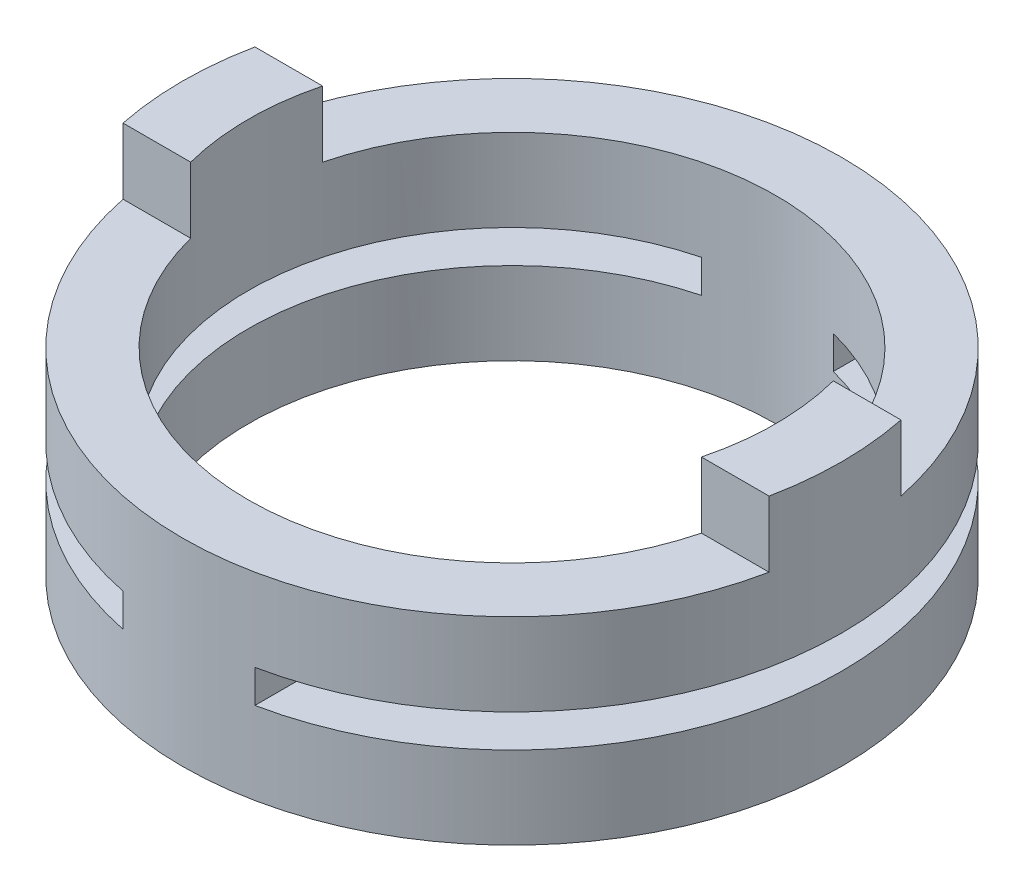
ISO-10303-21;
HEADER;
FILE_DESCRIPTION(('STEP AP214'),'2;1');
FILE_NAME('part.step','',(''),(''),'','','');
FILE_SCHEMA(('AUTOMOTIVE_DESIGN { 1 0 10303 214 1 1 1 1 }'));
ENDSEC;
DATA;
#1=APPLICATION_CONTEXT('core data for automotive mechanical design processes');
#2=APPLICATION_PROTOCOL_DEFINITION('international standard','automotive_design',2000,#1);
#3=PRODUCT_CONTEXT('',#1,'mechanical');
#4=PRODUCT('Part','Part','',(#3));
#5=PRODUCT_RELATED_PRODUCT_CATEGORY('part','',(#4));
#6=PRODUCT_DEFINITION_FORMATION('','',#4);
#7=PRODUCT_DEFINITION_CONTEXT('part definition',#1,'design');
#8=PRODUCT_DEFINITION('design','',#6,#7);
#9=PRODUCT_DEFINITION_SHAPE('','',#8);
#10=(LENGTH_UNIT() NAMED_UNIT(*) SI_UNIT(.MILLI.,.METRE.));
#11=(NAMED_UNIT(*) PLANE_ANGLE_UNIT() SI_UNIT($,.RADIAN.));
#12=(NAMED_UNIT(*) SI_UNIT($,.STERADIAN.) SOLID_ANGLE_UNIT());
#13=UNCERTAINTY_MEASURE_WITH_UNIT(LENGTH_MEASURE(1.E-05),#10,'distance_accuracy_value','');
#14=(GEOMETRIC_REPRESENTATION_CONTEXT(3) GLOBAL_UNCERTAINTY_ASSIGNED_CONTEXT((#13)) GLOBAL_UNIT_ASSIGNED_CONTEXT((#10,
#11,#12)) REPRESENTATION_CONTEXT('',''));
#15=CARTESIAN_POINT('',(0.,0.,0.));
#16=DIRECTION('',(0.,0.,1.));
#17=DIRECTION('',(1.,0.,0.));
#18=AXIS2_PLACEMENT_3D('',#15,#16,#17);
#19=CARTESIAN_POINT('',(0.,3.,0.));
#20=DIRECTION('',(0.,1.,0.));
#21=DIRECTION('',(0.,0.,1.));
#22=AXIS2_PLACEMENT_3D('',#19,#20,#21);
#23=PLANE('',#22);
#24=CARTESIAN_POINT('',(0.,3.,0.));
#25=DIRECTION('',(0.,1.,0.));
#26=DIRECTION('',(0.,0.,1.));
#27=AXIS2_PLACEMENT_3D('',#24,#25,#26);
#28=CIRCLE('',#27,4.);
#29=CARTESIAN_POINT('',(3.87298334620721,3.,1.));
#30=VERTEX_POINT('',#29);
#31=CARTESIAN_POINT('',(-3.87298334620721,3.,1.));
#32=VERTEX_POINT('',#31);
#33=EDGE_CURVE('E136',#30,#32,#28,.F.);
#34=ORIENTED_EDGE('',*,*,#33,.T.);
#35=DIRECTION('',(1.,0.,0.));
#36=VECTOR('',#35,1.);
#37=CARTESIAN_POINT('',(0.,3.,1.));
#38=LINE('',#37,#36);
#39=CARTESIAN_POINT('',(-4.89897948556635,3.,1.00000000000004));
#40=VERTEX_POINT('',#39);
#41=EDGE_CURVE('E132',#32,#40,#38,.F.);
#42=ORIENTED_EDGE('',*,*,#41,.T.);
#43=CARTESIAN_POINT('',(0.,3.,0.));
#44=DIRECTION('',(0.,1.,0.));
#45=DIRECTION('',(0.,0.,1.));
#46=AXIS2_PLACEMENT_3D('',#43,#44,#45);
#47=CIRCLE('',#46,5.);
#48=CARTESIAN_POINT('',(4.89897948556635,3.,1.00000000000004));
#49=VERTEX_POINT('',#48);
#50=EDGE_CURVE('E19',#49,#40,#47,.F.);
#51=ORIENTED_EDGE('',*,*,#50,.F.);
#52=DIRECTION('',(1.,0.,0.));
#53=VECTOR('',#52,1.);
#54=CARTESIAN_POINT('',(0.,3.,1.));
#55=LINE('',#54,#53);
#56=EDGE_CURVE('E126',#49,#30,#55,.F.);
#57=ORIENTED_EDGE('',*,*,#56,.T.);
#58=EDGE_LOOP('',(#34,#42,#51,#57));
#59=FACE_BOUND('',#58,.T.);
#60=ADVANCED_FACE('F16',(#59),#23,.T.);
#61=CARTESIAN_POINT('',(1.,1.75,-8.5));
#62=DIRECTION('',(-1.,0.,0.));
#63=DIRECTION('',(0.,0.,1.));
#64=AXIS2_PLACEMENT_3D('',#61,#62,#63);
#65=PLANE('',#64);
#66=DIRECTION('',(0.,1.,0.));
#67=VECTOR('',#66,1.);
#68=CARTESIAN_POINT('',(1.0000000000001,0.,3.87298334620739));
#69=LINE('',#68,#67);
#70=CARTESIAN_POINT('',(1.00000000000005,1.25,3.8729833462074));
#71=VERTEX_POINT('',#70);
#72=CARTESIAN_POINT('',(1.00000000000005,1.75,3.8729833462074));
#73=VERTEX_POINT('',#72);
#74=EDGE_CURVE('E166',#71,#73,#69,.T.);
#75=ORIENTED_EDGE('',*,*,#74,.T.);
#76=DIRECTION('',(0.,0.,1.));
#77=VECTOR('',#76,1.);
#78=CARTESIAN_POINT('',(1.,1.75,-8.5));
#79=LINE('',#78,#77);
#80=CARTESIAN_POINT('',(1.00000000000003,1.75,4.89897948556635));
#81=VERTEX_POINT('',#80);
#82=EDGE_CURVE('E215',#73,#81,#79,.T.);
#83=ORIENTED_EDGE('',*,*,#82,.T.);
#84=DIRECTION('',(0.,1.,0.));
#85=VECTOR('',#84,1.);
#86=CARTESIAN_POINT('',(1.00000000000007,0.,4.89897948556634));
#87=LINE('',#86,#85);
#88=CARTESIAN_POINT('',(1.00000000000003,1.25,4.89897948556635));
#89=VERTEX_POINT('',#88);
#90=EDGE_CURVE('E139',#89,#81,#87,.T.);
#91=ORIENTED_EDGE('',*,*,#90,.F.);
#92=DIRECTION('',(0.,0.,-1.));
#93=VECTOR('',#92,1.);
#94=CARTESIAN_POINT('',(1.,1.25,-8.5));
#95=LINE('',#94,#93);
#96=EDGE_CURVE('E212',#89,#71,#95,.T.);
#97=ORIENTED_EDGE('',*,*,#96,.T.);
#98=EDGE_LOOP('',(#75,#83,#91,#97));
#99=FACE_BOUND('',#98,.T.);
#100=ADVANCED_FACE('F275',(#99),#65,.F.);
#101=CARTESIAN_POINT('',(-1.,1.25,-8.5));
#102=DIRECTION('',(1.,0.,0.));
#103=DIRECTION('',(0.,0.,-1.));
#104=AXIS2_PLACEMENT_3D('',#101,#102,#103);
#105=PLANE('',#104);
#106=DIRECTION('',(0.,1.,0.));
#107=VECTOR('',#106,1.);
#108=CARTESIAN_POINT('',(-1.0000000000001,0.,3.87298334620739));
#109=LINE('',#108,#107);
#110=CARTESIAN_POINT('',(-1.00000000000005,1.75,3.8729833462074));
#111=VERTEX_POINT('',#110);
#112=CARTESIAN_POINT('',(-1.00000000000005,1.25,3.8729833462074));
#113=VERTEX_POINT('',#112);
#114=EDGE_CURVE('E220',#111,#113,#109,.F.);
#115=ORIENTED_EDGE('',*,*,#114,.T.);
#116=DIRECTION('',(0.,0.,-1.));
#117=VECTOR('',#116,1.);
#118=CARTESIAN_POINT('',(-1.,1.25,-8.5));
#119=LINE('',#118,#117);
#120=CARTESIAN_POINT('',(-1.,1.25,4.89897948556618));
#121=VERTEX_POINT('',#120);
#122=EDGE_CURVE('E205',#113,#121,#119,.F.);
#123=ORIENTED_EDGE('',*,*,#122,.T.);
#124=DIRECTION('',(0.,1.,0.));
#125=VECTOR('',#124,1.);
#126=CARTESIAN_POINT('',(-1.,1.25,4.898979485566));
#127=LINE('',#126,#125);
#128=CARTESIAN_POINT('',(-1.,1.75,4.89897948556618));
#129=VERTEX_POINT('',#128);
#130=EDGE_CURVE('E155',#129,#121,#127,.F.);
#131=ORIENTED_EDGE('',*,*,#130,.F.);
#132=DIRECTION('',(0.,0.,1.));
#133=VECTOR('',#132,1.);
#134=CARTESIAN_POINT('',(-1.,1.75,-8.5));
#135=LINE('',#134,#133);
#136=EDGE_CURVE('E201',#129,#111,#135,.F.);
#137=ORIENTED_EDGE('',*,*,#136,.T.);
#138=EDGE_LOOP('',(#115,#123,#131,#137));
#139=FACE_BOUND('',#138,.T.);
#140=ADVANCED_FACE('F430',(#139),#105,.F.);
#141=CARTESIAN_POINT('',(0.,0.,0.));
#142=DIRECTION('',(0.,1.,0.));
#143=DIRECTION('',(0.,0.,1.));
#144=AXIS2_PLACEMENT_3D('',#141,#142,#143);
#145=CYLINDRICAL_SURFACE('',#144,4.);
#146=CARTESIAN_POINT('',(0.,3.,0.));
#147=DIRECTION('',(0.,1.,0.));
#148=DIRECTION('',(0.,0.,1.));
#149=AXIS2_PLACEMENT_3D('',#146,#147,#148);
#150=CIRCLE('',#149,4.);
#151=CARTESIAN_POINT('',(-3.8729833462074,3.,-1.00000000000005));
#152=VERTEX_POINT('',#151);
#153=CARTESIAN_POINT('',(3.87298334620721,3.,-1.));
#154=VERTEX_POINT('',#153);
#155=EDGE_CURVE('E190',#152,#154,#150,.F.);
#156=ORIENTED_EDGE('',*,*,#155,.F.);
#157=DIRECTION('',(0.,1.,0.));
#158=VECTOR('',#157,1.);
#159=CARTESIAN_POINT('',(-3.87298334620739,0.,-1.0000000000001));
#160=LINE('',#159,#158);
#161=CARTESIAN_POINT('',(-3.8729833462074,4.,-1.00000000000005));
#162=VERTEX_POINT('',#161);
#163=EDGE_CURVE('E157',#162,#152,#160,.F.);
#164=ORIENTED_EDGE('',*,*,#163,.F.);
#165=CARTESIAN_POINT('',(0.,4.,0.));
#166=DIRECTION('',(0.,1.,0.));
#167=DIRECTION('',(0.,0.,1.));
#168=AXIS2_PLACEMENT_3D('',#165,#166,#167);
#169=CIRCLE('',#168,4.);
#170=CARTESIAN_POINT('',(-3.87298334620721,4.,1.));
#171=VERTEX_POINT('',#170);
#172=EDGE_CURVE('E195',#171,#162,#169,.F.);
#173=ORIENTED_EDGE('',*,*,#172,.F.);
#174=DIRECTION('',(0.,1.,0.));
#175=VECTOR('',#174,1.);
#176=CARTESIAN_POINT('',(-3.872983346207,3.,1.));
#177=LINE('',#176,#175);
#178=EDGE_CURVE('E249',#32,#171,#177,.T.);
#179=ORIENTED_EDGE('',*,*,#178,.F.);
#180=ORIENTED_EDGE('',*,*,#33,.F.);
#181=DIRECTION('',(0.,1.,0.));
#182=VECTOR('',#181,1.);
#183=CARTESIAN_POINT('',(3.872983346207,3.,1.));
#184=LINE('',#183,#182);
#185=CARTESIAN_POINT('',(3.87298334620721,4.,1.));
#186=VERTEX_POINT('',#185);
#187=EDGE_CURVE('E168',#186,#30,#184,.F.);
#188=ORIENTED_EDGE('',*,*,#187,.F.);
#189=CARTESIAN_POINT('',(0.,4.,0.));
#190=DIRECTION('',(0.,1.,0.));
#191=DIRECTION('',(0.,0.,1.));
#192=AXIS2_PLACEMENT_3D('',#189,#190,#191);
#193=CIRCLE('',#192,4.);
#194=CARTESIAN_POINT('',(3.87298334620721,4.,-1.));
#195=VERTEX_POINT('',#194);
#196=EDGE_CURVE('E216',#195,#186,#193,.F.);
#197=ORIENTED_EDGE('',*,*,#196,.F.);
#198=DIRECTION('',(0.,1.,0.));
#199=VECTOR('',#198,1.);
#200=CARTESIAN_POINT('',(3.872983346207,3.,-1.));
#201=LINE('',#200,#199);
#202=EDGE_CURVE('E218',#154,#195,#201,.T.);
#203=ORIENTED_EDGE('',*,*,#202,.F.);
#204=EDGE_LOOP('',(#156,#164,#173,#179,#180,#188,#197,#203));
#205=FACE_BOUND('',#204,.T.);
#206=DIRECTION('',(0.,1.,0.));
#207=VECTOR('',#206,1.);
#208=CARTESIAN_POINT('',(1.,1.75,-3.872983346207));
#209=LINE('',#208,#207);
#210=CARTESIAN_POINT('',(1.,1.25,-3.87298334620721));
#211=VERTEX_POINT('',#210);
#212=CARTESIAN_POINT('',(1.,1.75,-3.87298334620721));
#213=VERTEX_POINT('',#212);
#214=EDGE_CURVE('E234',#211,#213,#209,.T.);
#215=ORIENTED_EDGE('',*,*,#214,.T.);
#216=CARTESIAN_POINT('',(0.,1.75,0.));
#217=DIRECTION('',(0.,1.,0.));
#218=DIRECTION('',(0.,0.,1.));
#219=AXIS2_PLACEMENT_3D('',#216,#217,#218);
#220=CIRCLE('',#219,4.);
#221=EDGE_CURVE('E169',#213,#73,#220,.F.);
#222=ORIENTED_EDGE('',*,*,#221,.T.);
#223=ORIENTED_EDGE('',*,*,#74,.F.);
#224=CARTESIAN_POINT('',(0.,1.25,0.));
#225=DIRECTION('',(0.,1.,0.));
#226=DIRECTION('',(0.,0.,1.));
#227=AXIS2_PLACEMENT_3D('',#224,#225,#226);
#228=CIRCLE('',#227,4.);
#229=EDGE_CURVE('E210',#71,#211,#228,.T.);
#230=ORIENTED_EDGE('',*,*,#229,.T.);
#231=EDGE_LOOP('',(#215,#222,#223,#230));
#232=FACE_BOUND('',#231,.T.);
#233=CARTESIAN_POINT('',(0.,0.,0.));
#234=DIRECTION('',(0.,1.,0.));
#235=DIRECTION('',(0.,0.,1.));
#236=AXIS2_PLACEMENT_3D('',#233,#234,#235);
#237=CIRCLE('',#236,4.);
#238=CARTESIAN_POINT('',(0.,0.,4.));
#239=VERTEX_POINT('',#238);
#240=EDGE_CURVE('E206',#239,#239,#237,.F.);
#241=ORIENTED_EDGE('',*,*,#240,.T.);
#242=EDGE_LOOP('',(#241));
#243=FACE_BOUND('',#242,.T.);
#244=DIRECTION('',(0.,1.,0.));
#245=VECTOR('',#244,1.);
#246=CARTESIAN_POINT('',(-1.,1.25,-3.872983346207));
#247=LINE('',#246,#245);
#248=CARTESIAN_POINT('',(-1.,1.75,-3.87298334620721));
#249=VERTEX_POINT('',#248);
#250=CARTESIAN_POINT('',(-1.,1.25,-3.87298334620721));
#251=VERTEX_POINT('',#250);
#252=EDGE_CURVE('E232',#249,#251,#247,.F.);
#253=ORIENTED_EDGE('',*,*,#252,.T.);
#254=CARTESIAN_POINT('',(0.,1.25,0.));
#255=DIRECTION('',(0.,1.,0.));
#256=DIRECTION('',(0.,0.,1.));
#257=AXIS2_PLACEMENT_3D('',#254,#255,#256);
#258=CIRCLE('',#257,4.);
#259=EDGE_CURVE('E202',#251,#113,#258,.T.);
#260=ORIENTED_EDGE('',*,*,#259,.T.);
#261=ORIENTED_EDGE('',*,*,#114,.F.);
#262=CARTESIAN_POINT('',(0.,1.75,0.));
#263=DIRECTION('',(0.,1.,0.));
#264=DIRECTION('',(0.,0.,1.));
#265=AXIS2_PLACEMENT_3D('',#262,#263,#264);
#266=CIRCLE('',#265,4.);
#267=EDGE_CURVE('E198',#111,#249,#266,.F.);
#268=ORIENTED_EDGE('',*,*,#267,.T.);
#269=EDGE_LOOP('',(#253,#260,#261,#268));
#270=FACE_BOUND('',#269,.T.);
#271=ADVANCED_FACE('F276',(#205,#232,#243,#270),#145,.F.);
#272=CARTESIAN_POINT('',(4.898979485566,3.,-1.));
#273=DIRECTION('',(0.,0.,-1.));
#274=DIRECTION('',(-1.,0.,0.));
#275=AXIS2_PLACEMENT_3D('',#272,#273,#274);
#276=PLANE('',#275);
#277=DIRECTION('',(0.,1.,0.));
#278=VECTOR('',#277,1.);
#279=CARTESIAN_POINT('',(4.89897948556634,0.,-1.00000000000007));
#280=LINE('',#279,#278);
#281=CARTESIAN_POINT('',(4.89897948556635,3.,-1.00000000000003));
#282=VERTEX_POINT('',#281);
#283=CARTESIAN_POINT('',(4.89897948556635,4.,-1.00000000000003));
#284=VERTEX_POINT('',#283);
#285=EDGE_CURVE('E189',#282,#284,#280,.T.);
#286=ORIENTED_EDGE('',*,*,#285,.F.);
#287=DIRECTION('',(1.,0.,0.));
#288=VECTOR('',#287,1.);
#289=CARTESIAN_POINT('',(0.,3.,-1.));
#290=LINE('',#289,#288);
#291=EDGE_CURVE('E193',#154,#282,#290,.T.);
#292=ORIENTED_EDGE('',*,*,#291,.F.);
#293=ORIENTED_EDGE('',*,*,#202,.T.);
#294=DIRECTION('',(1.,0.,0.));
#295=VECTOR('',#294,1.);
#296=CARTESIAN_POINT('',(0.,4.,-1.));
#297=LINE('',#296,#295);
#298=EDGE_CURVE('E217',#284,#195,#297,.F.);
#299=ORIENTED_EDGE('',*,*,#298,.F.);
#300=EDGE_LOOP('',(#286,#292,#293,#299));
#301=FACE_BOUND('',#300,.T.);
#302=ADVANCED_FACE('F413',(#301),#276,.T.);
#303=CARTESIAN_POINT('',(0.,4.,0.));
#304=DIRECTION('',(0.,1.,0.));
#305=DIRECTION('',(0.,0.,1.));
#306=AXIS2_PLACEMENT_3D('',#303,#304,#305);
#307=PLANE('',#306);
#308=DIRECTION('',(1.,0.,0.));
#309=VECTOR('',#308,1.);
#310=CARTESIAN_POINT('',(3.872983346207,4.,1.));
#311=LINE('',#310,#309);
#312=CARTESIAN_POINT('',(4.89897948556635,4.,1.00000000000004));
#313=VERTEX_POINT('',#312);
#314=EDGE_CURVE('E170',#313,#186,#311,.F.);
#315=ORIENTED_EDGE('',*,*,#314,.F.);
#316=CARTESIAN_POINT('',(0.,4.,0.));
#317=DIRECTION('',(0.,1.,0.));
#318=DIRECTION('',(0.,0.,1.));
#319=AXIS2_PLACEMENT_3D('',#316,#317,#318);
#320=CIRCLE('',#319,5.);
#321=EDGE_CURVE('E187',#284,#313,#320,.F.);
#322=ORIENTED_EDGE('',*,*,#321,.F.);
#323=ORIENTED_EDGE('',*,*,#298,.T.);
#324=ORIENTED_EDGE('',*,*,#196,.T.);
#325=EDGE_LOOP('',(#315,#322,#323,#324));
#326=FACE_BOUND('',#325,.T.);
#327=ADVANCED_FACE('F289',(#326),#307,.T.);
#328=CARTESIAN_POINT('',(3.872983346207,3.,1.));
#329=DIRECTION('',(0.,0.,1.));
#330=DIRECTION('',(1.,0.,0.));
#331=AXIS2_PLACEMENT_3D('',#328,#329,#330);
#332=PLANE('',#331);
#333=ORIENTED_EDGE('',*,*,#187,.T.);
#334=ORIENTED_EDGE('',*,*,#56,.F.);
#335=DIRECTION('',(0.,1.,0.));
#336=VECTOR('',#335,1.);
#337=CARTESIAN_POINT('',(4.89897948556634,0.,1.00000000000007));
#338=LINE('',#337,#336);
#339=EDGE_CURVE('E154',#313,#49,#338,.F.);
#340=ORIENTED_EDGE('',*,*,#339,.F.);
#341=ORIENTED_EDGE('',*,*,#314,.T.);
#342=EDGE_LOOP('',(#333,#334,#340,#341));
#343=FACE_BOUND('',#342,.T.);
#344=ADVANCED_FACE('F281',(#343),#332,.T.);
#345=CARTESIAN_POINT('',(5.769806222619,1.75,-8.5));
#346=DIRECTION('',(0.,1.,0.));
#347=DIRECTION('',(0.,0.,1.));
#348=AXIS2_PLACEMENT_3D('',#345,#346,#347);
#349=PLANE('',#348);
#350=ORIENTED_EDGE('',*,*,#82,.F.);
#351=ORIENTED_EDGE('',*,*,#221,.F.);
#352=DIRECTION('',(0.,0.,1.));
#353=VECTOR('',#352,1.);
#354=CARTESIAN_POINT('',(1.,1.75,-8.5));
#355=LINE('',#354,#353);
#356=CARTESIAN_POINT('',(1.00000000000004,1.75,-4.89897948556635));
#357=VERTEX_POINT('',#356);
#358=EDGE_CURVE('E236',#213,#357,#355,.F.);
#359=ORIENTED_EDGE('',*,*,#358,.T.);
#360=CARTESIAN_POINT('',(0.,1.75,0.));
#361=DIRECTION('',(0.,1.,0.));
#362=DIRECTION('',(0.,0.,1.));
#363=AXIS2_PLACEMENT_3D('',#360,#361,#362);
#364=CIRCLE('',#363,5.);
#365=EDGE_CURVE('E185',#81,#357,#364,.T.);
#366=ORIENTED_EDGE('',*,*,#365,.F.);
#367=EDGE_LOOP('',(#350,#351,#359,#366));
#368=FACE_BOUND('',#367,.T.);
#369=ADVANCED_FACE('F279',(#368),#349,.F.);
#370=CARTESIAN_POINT('',(1.,1.75,-8.5));
#371=DIRECTION('',(-1.,0.,0.));
#372=DIRECTION('',(0.,0.,1.));
#373=AXIS2_PLACEMENT_3D('',#370,#371,#372);
#374=PLANE('',#373);
#375=ORIENTED_EDGE('',*,*,#214,.F.);
#376=DIRECTION('',(0.,0.,-1.));
#377=VECTOR('',#376,1.);
#378=CARTESIAN_POINT('',(1.,1.25,-8.5));
#379=LINE('',#378,#377);
#380=CARTESIAN_POINT('',(1.00000000000004,1.25,-4.89897948556635));
#381=VERTEX_POINT('',#380);
#382=EDGE_CURVE('E209',#211,#381,#379,.T.);
#383=ORIENTED_EDGE('',*,*,#382,.T.);
#384=DIRECTION('',(0.,1.,0.));
#385=VECTOR('',#384,1.);
#386=CARTESIAN_POINT('',(1.00000000000007,0.,-4.89897948556634));
#387=LINE('',#386,#385);
#388=EDGE_CURVE('E184',#357,#381,#387,.F.);
#389=ORIENTED_EDGE('',*,*,#388,.F.);
#390=ORIENTED_EDGE('',*,*,#358,.F.);
#391=EDGE_LOOP('',(#375,#383,#389,#390));
#392=FACE_BOUND('',#391,.T.);
#393=ADVANCED_FACE('F270',(#392),#374,.F.);
#394=CARTESIAN_POINT('',(1.,1.25,-8.5));
#395=DIRECTION('',(0.,-1.,0.));
#396=DIRECTION('',(0.,0.,-1.));
#397=AXIS2_PLACEMENT_3D('',#394,#395,#396);
#398=PLANE('',#397);
#399=ORIENTED_EDGE('',*,*,#229,.F.);
#400=ORIENTED_EDGE('',*,*,#96,.F.);
#401=CARTESIAN_POINT('',(0.,1.25,0.));
#402=DIRECTION('',(0.,1.,0.));
#403=DIRECTION('',(0.,0.,1.));
#404=AXIS2_PLACEMENT_3D('',#401,#402,#403);
#405=CIRCLE('',#404,5.);
#406=EDGE_CURVE('E182',#381,#89,#405,.F.);
#407=ORIENTED_EDGE('',*,*,#406,.F.);
#408=ORIENTED_EDGE('',*,*,#382,.F.);
#409=EDGE_LOOP('',(#399,#400,#407,#408));
#410=FACE_BOUND('',#409,.T.);
#411=ADVANCED_FACE('F274',(#410),#398,.F.);
#412=CARTESIAN_POINT('',(0.,0.,0.));
#413=DIRECTION('',(0.,1.,0.));
#414=DIRECTION('',(0.,0.,1.));
#415=AXIS2_PLACEMENT_3D('',#412,#413,#414);
#416=PLANE('',#415);
#417=ORIENTED_EDGE('',*,*,#240,.F.);
#418=EDGE_LOOP('',(#417));
#419=FACE_BOUND('',#418,.T.);
#420=CARTESIAN_POINT('',(0.,0.,0.));
#421=DIRECTION('',(0.,1.,0.));
#422=DIRECTION('',(0.,0.,1.));
#423=AXIS2_PLACEMENT_3D('',#420,#421,#422);
#424=CIRCLE('',#423,5.);
#425=CARTESIAN_POINT('',(0.,0.,5.));
#426=VERTEX_POINT('',#425);
#427=EDGE_CURVE('E179',#426,#426,#424,.T.);
#428=ORIENTED_EDGE('',*,*,#427,.F.);
#429=EDGE_LOOP('',(#428));
#430=FACE_BOUND('',#429,.T.);
#431=ADVANCED_FACE('F321',(#419,#430),#416,.F.);
#432=CARTESIAN_POINT('',(-5.769806222619,1.25,-8.5));
#433=DIRECTION('',(0.,-1.,0.));
#434=DIRECTION('',(0.,0.,-1.));
#435=AXIS2_PLACEMENT_3D('',#432,#433,#434);
#436=PLANE('',#435);
#437=ORIENTED_EDGE('',*,*,#122,.F.);
#438=ORIENTED_EDGE('',*,*,#259,.F.);
#439=DIRECTION('',(0.,0.,-1.));
#440=VECTOR('',#439,1.);
#441=CARTESIAN_POINT('',(-1.,1.25,-8.5));
#442=LINE('',#441,#440);
#443=CARTESIAN_POINT('',(-1.00000000000003,1.25,-4.89897948556635));
#444=VERTEX_POINT('',#443);
#445=EDGE_CURVE('E260',#251,#444,#442,.T.);
#446=ORIENTED_EDGE('',*,*,#445,.T.);
#447=CARTESIAN_POINT('',(0.,1.25,0.));
#448=DIRECTION('',(0.,1.,0.));
#449=DIRECTION('',(0.,0.,1.));
#450=AXIS2_PLACEMENT_3D('',#447,#448,#449);
#451=CIRCLE('',#450,5.);
#452=EDGE_CURVE('E176',#121,#444,#451,.F.);
#453=ORIENTED_EDGE('',*,*,#452,.F.);
#454=EDGE_LOOP('',(#437,#438,#446,#453));
#455=FACE_BOUND('',#454,.T.);
#456=ADVANCED_FACE('F318',(#455),#436,.F.);
#457=CARTESIAN_POINT('',(-1.,1.25,-8.5));
#458=DIRECTION('',(1.,0.,0.));
#459=DIRECTION('',(0.,0.,-1.));
#460=AXIS2_PLACEMENT_3D('',#457,#458,#459);
#461=PLANE('',#460);
#462=ORIENTED_EDGE('',*,*,#252,.F.);
#463=DIRECTION('',(0.,0.,1.));
#464=VECTOR('',#463,1.);
#465=CARTESIAN_POINT('',(-1.,1.75,-8.5));
#466=LINE('',#465,#464);
#467=CARTESIAN_POINT('',(-1.00000000000003,1.75,-4.89897948556635));
#468=VERTEX_POINT('',#467);
#469=EDGE_CURVE('E200',#249,#468,#466,.F.);
#470=ORIENTED_EDGE('',*,*,#469,.T.);
#471=DIRECTION('',(0.,1.,0.));
#472=VECTOR('',#471,1.);
#473=CARTESIAN_POINT('',(-1.00000000000007,0.,-4.89897948556634));
#474=LINE('',#473,#472);
#475=EDGE_CURVE('E175',#444,#468,#474,.T.);
#476=ORIENTED_EDGE('',*,*,#475,.F.);
#477=ORIENTED_EDGE('',*,*,#445,.F.);
#478=EDGE_LOOP('',(#462,#470,#476,#477));
#479=FACE_BOUND('',#478,.T.);
#480=ADVANCED_FACE('F314',(#479),#461,.F.);
#481=CARTESIAN_POINT('',(-1.,1.75,-8.5));
#482=DIRECTION('',(0.,1.,0.));
#483=DIRECTION('',(0.,0.,1.));
#484=AXIS2_PLACEMENT_3D('',#481,#482,#483);
#485=PLANE('',#484);
#486=ORIENTED_EDGE('',*,*,#267,.F.);
#487=ORIENTED_EDGE('',*,*,#136,.F.);
#488=CARTESIAN_POINT('',(0.,1.75,0.));
#489=DIRECTION('',(0.,1.,0.));
#490=DIRECTION('',(0.,0.,1.));
#491=AXIS2_PLACEMENT_3D('',#488,#489,#490);
#492=CIRCLE('',#491,5.);
#493=EDGE_CURVE('E150',#468,#129,#492,.T.);
#494=ORIENTED_EDGE('',*,*,#493,.F.);
#495=ORIENTED_EDGE('',*,*,#469,.F.);
#496=EDGE_LOOP('',(#486,#487,#494,#495));
#497=FACE_BOUND('',#496,.T.);
#498=ADVANCED_FACE('F311',(#497),#485,.F.);
#499=CARTESIAN_POINT('',(-4.898979485566,3.,1.));
#500=DIRECTION('',(0.,0.,1.));
#501=DIRECTION('',(1.,0.,0.));
#502=AXIS2_PLACEMENT_3D('',#499,#500,#501);
#503=PLANE('',#502);
#504=DIRECTION('',(0.,1.,0.));
#505=VECTOR('',#504,1.);
#506=CARTESIAN_POINT('',(-4.89897948556634,0.,1.00000000000007));
#507=LINE('',#506,#505);
#508=CARTESIAN_POINT('',(-4.89897948556635,4.,1.00000000000003));
#509=VERTEX_POINT('',#508);
#510=EDGE_CURVE('E142',#40,#509,#507,.T.);
#511=ORIENTED_EDGE('',*,*,#510,.F.);
#512=ORIENTED_EDGE('',*,*,#41,.F.);
#513=ORIENTED_EDGE('',*,*,#178,.T.);
#514=DIRECTION('',(1.,0.,0.));
#515=VECTOR('',#514,1.);
#516=CARTESIAN_POINT('',(0.,4.,1.));
#517=LINE('',#516,#515);
#518=EDGE_CURVE('E145',#509,#171,#517,.T.);
#519=ORIENTED_EDGE('',*,*,#518,.F.);
#520=EDGE_LOOP('',(#511,#512,#513,#519));
#521=FACE_BOUND('',#520,.T.);
#522=ADVANCED_FACE('F143',(#521),#503,.T.);
#523=CARTESIAN_POINT('',(0.,4.,0.));
#524=DIRECTION('',(0.,1.,0.));
#525=DIRECTION('',(0.,0.,1.));
#526=AXIS2_PLACEMENT_3D('',#523,#524,#525);
#527=PLANE('',#526);
#528=DIRECTION('',(-1.,0.,0.));
#529=VECTOR('',#528,1.);
#530=CARTESIAN_POINT('',(-3.872983346207,4.,-1.));
#531=LINE('',#530,#529);
#532=CARTESIAN_POINT('',(-4.89897948556635,4.,-1.00000000000004));
#533=VERTEX_POINT('',#532);
#534=EDGE_CURVE('E194',#533,#162,#531,.F.);
#535=ORIENTED_EDGE('',*,*,#534,.F.);
#536=CARTESIAN_POINT('',(0.,4.,0.));
#537=DIRECTION('',(0.,1.,0.));
#538=DIRECTION('',(0.,0.,1.));
#539=AXIS2_PLACEMENT_3D('',#536,#537,#538);
#540=CIRCLE('',#539,5.);
#541=EDGE_CURVE('E149',#509,#533,#540,.F.);
#542=ORIENTED_EDGE('',*,*,#541,.F.);
#543=ORIENTED_EDGE('',*,*,#518,.T.);
#544=ORIENTED_EDGE('',*,*,#172,.T.);
#545=EDGE_LOOP('',(#535,#542,#543,#544));
#546=FACE_BOUND('',#545,.T.);
#547=ADVANCED_FACE('F305',(#546),#527,.T.);
#548=CARTESIAN_POINT('',(-3.872983346207,3.,-1.));
#549=DIRECTION('',(0.,0.,-1.));
#550=DIRECTION('',(-1.,0.,0.));
#551=AXIS2_PLACEMENT_3D('',#548,#549,#550);
#552=PLANE('',#551);
#553=ORIENTED_EDGE('',*,*,#163,.T.);
#554=DIRECTION('',(1.,0.,0.));
#555=VECTOR('',#554,1.);
#556=CARTESIAN_POINT('',(0.,3.,-1.));
#557=LINE('',#556,#555);
#558=CARTESIAN_POINT('',(-4.89897948556635,3.,-1.00000000000004));
#559=VERTEX_POINT('',#558);
#560=EDGE_CURVE('E34',#559,#152,#557,.T.);
#561=ORIENTED_EDGE('',*,*,#560,.F.);
#562=DIRECTION('',(0.,1.,0.));
#563=VECTOR('',#562,1.);
#564=CARTESIAN_POINT('',(-4.89897948556634,0.,-1.00000000000007));
#565=LINE('',#564,#563);
#566=EDGE_CURVE('E25',#533,#559,#565,.F.);
#567=ORIENTED_EDGE('',*,*,#566,.F.);
#568=ORIENTED_EDGE('',*,*,#534,.T.);
#569=EDGE_LOOP('',(#553,#561,#567,#568));
#570=FACE_BOUND('',#569,.T.);
#571=ADVANCED_FACE('F298',(#570),#552,.T.);
#572=CARTESIAN_POINT('',(0.,3.,0.));
#573=DIRECTION('',(0.,1.,0.));
#574=DIRECTION('',(0.,0.,1.));
#575=AXIS2_PLACEMENT_3D('',#572,#573,#574);
#576=PLANE('',#575);
#577=CARTESIAN_POINT('',(0.,3.,0.));
#578=DIRECTION('',(0.,1.,0.));
#579=DIRECTION('',(0.,0.,1.));
#580=AXIS2_PLACEMENT_3D('',#577,#578,#579);
#581=CIRCLE('',#580,5.);
#582=EDGE_CURVE('E11',#559,#282,#581,.F.);
#583=ORIENTED_EDGE('',*,*,#582,.F.);
#584=ORIENTED_EDGE('',*,*,#560,.T.);
#585=ORIENTED_EDGE('',*,*,#155,.T.);
#586=ORIENTED_EDGE('',*,*,#291,.T.);
#587=EDGE_LOOP('',(#583,#584,#585,#586));
#588=FACE_BOUND('',#587,.T.);
#589=ADVANCED_FACE('F292',(#588),#576,.T.);
#590=CARTESIAN_POINT('',(0.,0.,0.));
#591=DIRECTION('',(0.,1.,0.));
#592=DIRECTION('',(0.,0.,1.));
#593=AXIS2_PLACEMENT_3D('',#590,#591,#592);
#594=CYLINDRICAL_SURFACE('',#593,5.);
#595=ORIENTED_EDGE('',*,*,#493,.T.);
#596=ORIENTED_EDGE('',*,*,#130,.T.);
#597=ORIENTED_EDGE('',*,*,#452,.T.);
#598=ORIENTED_EDGE('',*,*,#475,.T.);
#599=EDGE_LOOP('',(#595,#596,#597,#598));
#600=FACE_BOUND('',#599,.T.);
#601=ORIENTED_EDGE('',*,*,#427,.T.);
#602=EDGE_LOOP('',(#601));
#603=FACE_BOUND('',#602,.T.);
#604=ORIENTED_EDGE('',*,*,#406,.T.);
#605=ORIENTED_EDGE('',*,*,#90,.T.);
#606=ORIENTED_EDGE('',*,*,#365,.T.);
#607=ORIENTED_EDGE('',*,*,#388,.T.);
#608=EDGE_LOOP('',(#604,#605,#606,#607));
#609=FACE_BOUND('',#608,.T.);
#610=ORIENTED_EDGE('',*,*,#339,.T.);
#611=ORIENTED_EDGE('',*,*,#50,.T.);
#612=ORIENTED_EDGE('',*,*,#510,.T.);
#613=ORIENTED_EDGE('',*,*,#541,.T.);
#614=ORIENTED_EDGE('',*,*,#566,.T.);
#615=ORIENTED_EDGE('',*,*,#582,.T.);
#616=ORIENTED_EDGE('',*,*,#285,.T.);
#617=ORIENTED_EDGE('',*,*,#321,.T.);
#618=EDGE_LOOP('',(#610,#611,#612,#613,#614,#615,#616,#617));
#619=FACE_BOUND('',#618,.T.);
#620=ADVANCED_FACE('F152',(#600,#603,#609,#619),#594,.T.);
#621=CLOSED_SHELL('',(#60,#100,#140,#271,#302,#327,#344,#369,#393,#411,#431,#456,#480,#498,#522,
#547,#571,#589,#620));
#622=MANIFOLD_SOLID_BREP('B1',#621);
#623=ADVANCED_BREP_SHAPE_REPRESENTATION('',(#18,#622),#14);
#624=SHAPE_DEFINITION_REPRESENTATION(#9,#623);
ENDSEC;
END-ISO-10303-21;
